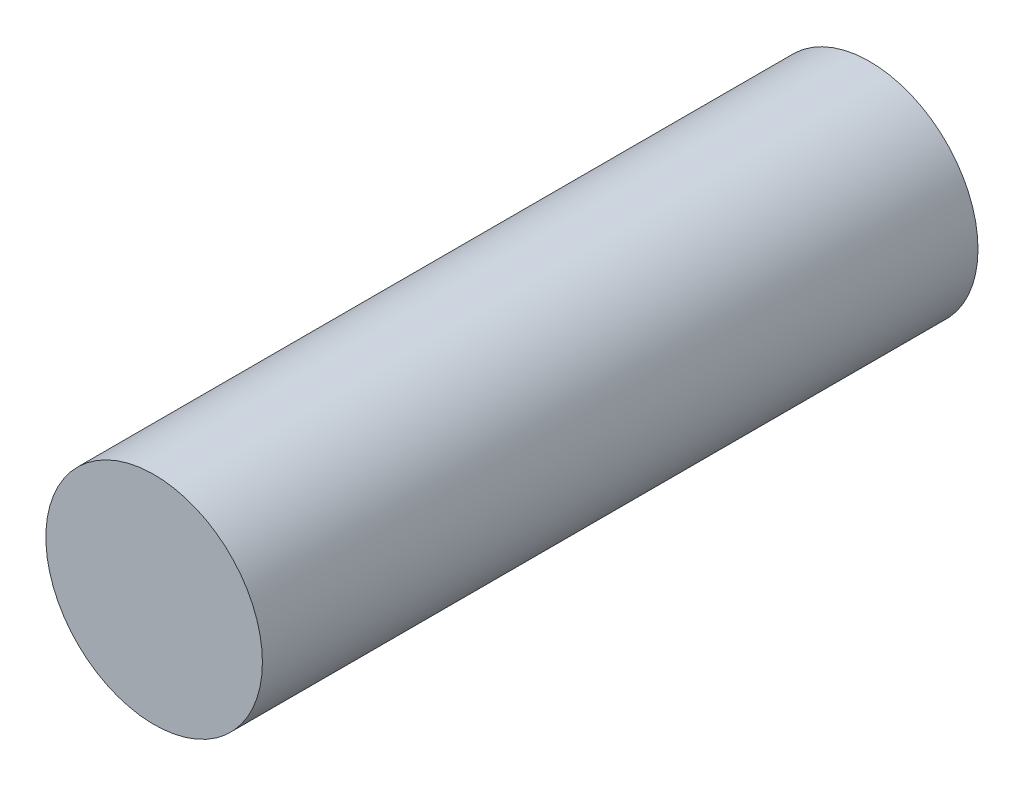
ISO-10303-21;
HEADER;
FILE_DESCRIPTION(('STEP AP214'),'2;1');
FILE_NAME('part.step','',(''),(''),'','','');
FILE_SCHEMA(('AUTOMOTIVE_DESIGN { 1 0 10303 214 1 1 1 1 }'));
ENDSEC;
DATA;
#1=APPLICATION_CONTEXT('core data for automotive mechanical design processes');
#2=APPLICATION_PROTOCOL_DEFINITION('international standard','automotive_design',2000,#1);
#3=PRODUCT_CONTEXT('',#1,'mechanical');
#4=PRODUCT('Part','Part','',(#3));
#5=PRODUCT_RELATED_PRODUCT_CATEGORY('part','',(#4));
#6=PRODUCT_DEFINITION_FORMATION('','',#4);
#7=PRODUCT_DEFINITION_CONTEXT('part definition',#1,'design');
#8=PRODUCT_DEFINITION('design','',#6,#7);
#9=PRODUCT_DEFINITION_SHAPE('','',#8);
#10=(LENGTH_UNIT() NAMED_UNIT(*) SI_UNIT(.MILLI.,.METRE.));
#11=(NAMED_UNIT(*) PLANE_ANGLE_UNIT() SI_UNIT($,.RADIAN.));
#12=(NAMED_UNIT(*) SI_UNIT($,.STERADIAN.) SOLID_ANGLE_UNIT());
#13=UNCERTAINTY_MEASURE_WITH_UNIT(LENGTH_MEASURE(1.E-05),#10,'distance_accuracy_value','');
#14=(GEOMETRIC_REPRESENTATION_CONTEXT(3) GLOBAL_UNCERTAINTY_ASSIGNED_CONTEXT((#13)) GLOBAL_UNIT_ASSIGNED_CONTEXT((#10,
#11,#12)) REPRESENTATION_CONTEXT('',''));
#15=CARTESIAN_POINT('',(0.,0.,0.));
#16=DIRECTION('',(0.,0.,1.));
#17=DIRECTION('',(1.,0.,0.));
#18=AXIS2_PLACEMENT_3D('',#15,#16,#17);
#19=CARTESIAN_POINT('',(0.,0.,60.325));
#20=DIRECTION('',(0.,0.,-1.));
#21=DIRECTION('',(-1.,0.,0.));
#22=AXIS2_PLACEMENT_3D('',#19,#20,#21);
#23=CYLINDRICAL_SURFACE('',#22,18.25625);
#24=CARTESIAN_POINT('',(0.,0.,60.325));
#25=DIRECTION('',(0.,0.,1.));
#26=DIRECTION('',(1.,0.,0.));
#27=AXIS2_PLACEMENT_3D('',#24,#25,#26);
#28=CIRCLE('',#27,18.25625);
#29=CARTESIAN_POINT('',(18.25625,0.,60.325));
#30=VERTEX_POINT('',#29);
#31=EDGE_CURVE('E10',#30,#30,#28,.T.);
#32=ORIENTED_EDGE('',*,*,#31,.F.);
#33=EDGE_LOOP('',(#32));
#34=FACE_BOUND('',#33,.T.);
#35=CARTESIAN_POINT('',(0.,0.,-60.325));
#36=DIRECTION('',(0.,0.,1.));
#37=DIRECTION('',(1.,0.,0.));
#38=AXIS2_PLACEMENT_3D('',#35,#36,#37);
#39=CIRCLE('',#38,18.25625);
#40=CARTESIAN_POINT('',(18.25625,0.,-60.325));
#41=VERTEX_POINT('',#40);
#42=EDGE_CURVE('E38',#41,#41,#39,.T.);
#43=ORIENTED_EDGE('',*,*,#42,.T.);
#44=EDGE_LOOP('',(#43));
#45=FACE_BOUND('',#44,.T.);
#46=ADVANCED_FACE('F35',(#34,#45),#23,.T.);
#47=CARTESIAN_POINT('',(0.,0.,60.325));
#48=DIRECTION('',(0.,0.,1.));
#49=DIRECTION('',(1.,0.,0.));
#50=AXIS2_PLACEMENT_3D('',#47,#48,#49);
#51=PLANE('',#50);
#52=ORIENTED_EDGE('',*,*,#31,.T.);
#53=EDGE_LOOP('',(#52));
#54=FACE_BOUND('',#53,.T.);
#55=ADVANCED_FACE('F50',(#54),#51,.T.);
#56=CARTESIAN_POINT('',(0.,0.,-60.325));
#57=DIRECTION('',(0.,0.,1.));
#58=DIRECTION('',(1.,0.,0.));
#59=AXIS2_PLACEMENT_3D('',#56,#57,#58);
#60=PLANE('',#59);
#61=ORIENTED_EDGE('',*,*,#42,.F.);
#62=EDGE_LOOP('',(#61));
#63=FACE_BOUND('',#62,.T.);
#64=ADVANCED_FACE('F48',(#63),#60,.F.);
#65=CLOSED_SHELL('',(#46,#55,#64));
#66=MANIFOLD_SOLID_BREP('B2',#65);
#67=ADVANCED_BREP_SHAPE_REPRESENTATION('',(#18,#66),#14);
#68=SHAPE_DEFINITION_REPRESENTATION(#9,#67);
ENDSEC;
END-ISO-10303-21;
